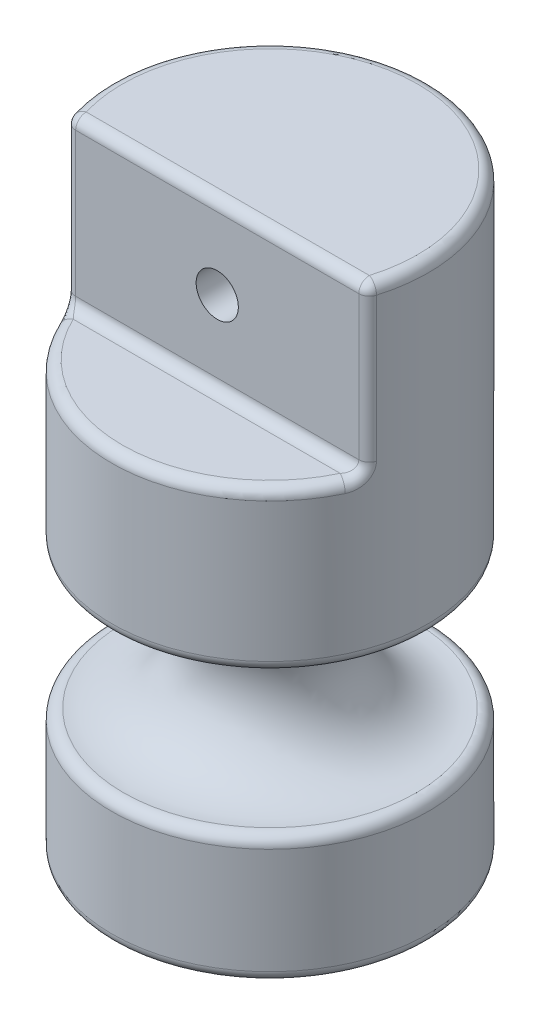
ISO-10303-21;
HEADER;
FILE_DESCRIPTION(('STEP AP214'),'2;1');
FILE_NAME('part.step','',(''),(''),'','','');
FILE_SCHEMA(('AUTOMOTIVE_DESIGN { 1 0 10303 214 1 1 1 1 }'));
ENDSEC;
DATA;
#1=APPLICATION_CONTEXT('core data for automotive mechanical design processes');
#2=APPLICATION_PROTOCOL_DEFINITION('international standard','automotive_design',2000,#1);
#3=PRODUCT_CONTEXT('',#1,'mechanical');
#4=PRODUCT('Part','Part','',(#3));
#5=PRODUCT_RELATED_PRODUCT_CATEGORY('part','',(#4));
#6=PRODUCT_DEFINITION_FORMATION('','',#4);
#7=PRODUCT_DEFINITION_CONTEXT('part definition',#1,'design');
#8=PRODUCT_DEFINITION('design','',#6,#7);
#9=PRODUCT_DEFINITION_SHAPE('','',#8);
#10=(LENGTH_UNIT() NAMED_UNIT(*) SI_UNIT(.MILLI.,.METRE.));
#11=(NAMED_UNIT(*) PLANE_ANGLE_UNIT() SI_UNIT($,.RADIAN.));
#12=(NAMED_UNIT(*) SI_UNIT($,.STERADIAN.) SOLID_ANGLE_UNIT());
#13=UNCERTAINTY_MEASURE_WITH_UNIT(LENGTH_MEASURE(1.E-05),#10,'distance_accuracy_value','');
#14=(GEOMETRIC_REPRESENTATION_CONTEXT(3) GLOBAL_UNCERTAINTY_ASSIGNED_CONTEXT((#13)) GLOBAL_UNIT_ASSIGNED_CONTEXT((#10,
#11,#12)) REPRESENTATION_CONTEXT('',''));
#15=CARTESIAN_POINT('',(0.,0.,0.));
#16=DIRECTION('',(0.,0.,1.));
#17=DIRECTION('',(1.,0.,0.));
#18=AXIS2_PLACEMENT_3D('',#15,#16,#17);
#19=CARTESIAN_POINT('',(0.,28.575,0.));
#20=DIRECTION('',(0.,-1.,0.));
#21=DIRECTION('',(0.,0.,-1.));
#22=AXIS2_PLACEMENT_3D('',#19,#20,#21);
#23=CYLINDRICAL_SURFACE('',#22,7.62);
#24=DIRECTION('',(0.,-1.,0.));
#25=VECTOR('',#24,1.);
#26=CARTESIAN_POINT('',(-7.30235913794931,28.575,2.17714285714286));
#27=LINE('',#26,#25);
#28=CARTESIAN_POINT('',(-7.30235913794931,21.1455,2.17714285714286));
#29=VERTEX_POINT('',#28);
#30=CARTESIAN_POINT('',(-7.30235913794931,28.067,2.17714285714286));
#31=VERTEX_POINT('',#30);
#32=EDGE_CURVE('E218',#29,#31,#27,.F.);
#33=ORIENTED_EDGE('',*,*,#32,.T.);
#34=CARTESIAN_POINT('',(0.,28.067,0.));
#35=DIRECTION('',(0.,1.,0.));
#36=DIRECTION('',(0.,0.,1.));
#37=AXIS2_PLACEMENT_3D('',#34,#35,#36);
#38=CIRCLE('',#37,7.62);
#39=CARTESIAN_POINT('',(7.30235913794931,28.067,2.17714285714286));
#40=VERTEX_POINT('',#39);
#41=EDGE_CURVE('E222',#31,#40,#38,.F.);
#42=ORIENTED_EDGE('',*,*,#41,.T.);
#43=DIRECTION('',(0.,-1.,0.));
#44=VECTOR('',#43,1.);
#45=CARTESIAN_POINT('',(7.30235913794931,28.575,2.17714285714286));
#46=LINE('',#45,#44);
#47=CARTESIAN_POINT('',(7.30235913794931,21.1455,2.17714285714286));
#48=VERTEX_POINT('',#47);
#49=EDGE_CURVE('E226',#40,#48,#46,.T.);
#50=ORIENTED_EDGE('',*,*,#49,.T.);
#51=CARTESIAN_POINT('',(6.79968366563213,21.306580535775,2.56621471484234));
#52=CARTESIAN_POINT('',(7.17973544291959,21.3416162058101,2.57792857301601));
#53=CARTESIAN_POINT('',(7.28537535603443,21.4676610715499,2.23331724609072));
#54=CARTESIAN_POINT('',(6.80497774516949,21.2807494491054,2.55754895045457));
#55=CARTESIAN_POINT('',(7.18453571792267,21.3104592178966,2.56537738077982));
#56=CARTESIAN_POINT('',(7.29104758409975,21.4159988982106,2.21474775097065));
#57=CARTESIAN_POINT('',(6.80894172480162,21.2541491386727,2.55099452658878));
#58=CARTESIAN_POINT('',(7.18814726576875,21.2781217778688,2.55589221225212));
#59=CARTESIAN_POINT('',(7.29529470513939,21.3627982773454,2.20070255697424));
#60=CARTESIAN_POINT('',(6.81421951672,21.2001992020795,2.54222267951877));
#61=CARTESIAN_POINT('',(7.19296371447863,21.2123725259241,2.54321396501279));
#62=CARTESIAN_POINT('',(7.30094948220521,21.254898404159,2.18190574182765));
#63=CARTESIAN_POINT('',(6.81553536425887,21.1728501677589,2.54000192566209));
#64=CARTESIAN_POINT('',(7.19417533686246,21.1789286468267,2.54000326881183));
#65=CARTESIAN_POINT('',(7.30235931885919,21.2002003355179,2.17714698356503));
#66=CARTESIAN_POINT('',(6.81553502530215,21.1179428590435,2.53999805976541));
#67=CARTESIAN_POINT('',(7.19417674767524,21.1118183333177,2.53999670644669));
#68=CARTESIAN_POINT('',(7.3023589556704,21.0903857180868,2.17713869949386));
#69=CARTESIAN_POINT('',(6.81419884545643,21.090384567429,2.5422486568872));
#70=CARTESIAN_POINT('',(7.19294813218279,21.0781197230295,2.54324958636573));
#71=CARTESIAN_POINT('',(7.30092733438081,21.0352691348577,2.18196140760333));
#72=CARTESIAN_POINT('',(6.80884454082101,21.0360668663769,2.55116480339701));
#73=CARTESIAN_POINT('',(7.18805509099758,21.0119226999059,2.55614048338698));
#74=CARTESIAN_POINT('',(7.29519057948787,20.926633732754,2.20106743586281));
#75=CARTESIAN_POINT('',(6.80482701876318,21.0093072788126,2.55782936057996));
#76=CARTESIAN_POINT('',(7.18438623490935,20.9793909218024,2.56579014755862));
#77=CARTESIAN_POINT('',(7.29088609166865,20.8731145576262,2.2153486298591));
#78=CARTESIAN_POINT('',(6.79409448148658,20.9573652018342,2.57532711071325));
#79=CARTESIAN_POINT('',(7.17467069258983,20.916694734701,2.59114753974169));
#80=CARTESIAN_POINT('',(7.27938694431339,20.7692304036675,2.25284380862639));
#81=CARTESIAN_POINT('',(6.78738238473865,20.9321810400903,2.58615579300261));
#82=CARTESIAN_POINT('',(7.16861561124709,20.8864947109692,2.60687702372217));
#83=CARTESIAN_POINT('',(7.2721954117109,20.7188620801766,2.27604812769551));
#84=CARTESIAN_POINT('',(6.77123490296656,20.8840117321596,2.61161589636088));
#85=CARTESIAN_POINT('',(7.15421729603453,20.8294712581727,2.64388692038416));
#86=CARTESIAN_POINT('',(7.25489453844513,20.6225234643209,2.33060549206124));
#87=CARTESIAN_POINT('',(6.76179579405356,20.8610296505729,2.62625251464366));
#88=CARTESIAN_POINT('',(7.14585232323247,20.802622392107,2.66522159925379));
#89=CARTESIAN_POINT('',(7.24478120790206,20.5765593011558,2.36196967424511));
#90=CARTESIAN_POINT('',(6.74010303868604,20.8176647043001,2.65898372414991));
#91=CARTESIAN_POINT('',(7.12690117420171,20.7530807193242,2.71292673382528));
#92=CARTESIAN_POINT('',(7.22153897003336,20.48982940859,2.43210798031245));
#93=CARTESIAN_POINT('',(6.72782106973793,20.7973114421398,2.67711278219986));
#94=CARTESIAN_POINT('',(7.11626467902644,20.7304136706803,2.7394150836419));
#95=CARTESIAN_POINT('',(7.20837971717004,20.4491228842407,2.47095596167793));
#96=CARTESIAN_POINT('',(6.70057507589932,20.7599544914172,2.71611391150444));
#97=CARTESIAN_POINT('',(7.09307171316821,20.6904312656857,2.79629729039291));
#98=CARTESIAN_POINT('',(7.17918758085032,20.3744089828083,2.55452981017262));
#99=CARTESIAN_POINT('',(6.68561011405877,20.7429519773653,2.73698694032223));
#100=CARTESIAN_POINT('',(7.08047582751609,20.6731140528903,2.82678168510133));
#101=CARTESIAN_POINT('',(7.16315369351915,20.3404039547464,2.59925772922304));
#102=CARTESIAN_POINT('',(6.65253752831066,20.7120469774421,2.78164032310655));
#103=CARTESIAN_POINT('',(7.05319047620054,20.6439132147723,2.89173048537433));
#104=CARTESIAN_POINT('',(7.12771878045249,20.2785939548678,2.69494354955439));
#105=CARTESIAN_POINT('',(6.63433194439553,20.6982871692617,2.80550111237467));
#106=CARTESIAN_POINT('',(7.03839248511933,20.6322929687462,2.92640359435825));
#107=CARTESIAN_POINT('',(7.10821279754744,20.2510743384284,2.74607381218687));
#108=CARTESIAN_POINT('',(6.59548990014568,20.6749333804866,2.85468140255819));
#109=CARTESIAN_POINT('',(7.00759966208699,20.6159059748189,2.99729222744497));
#110=CARTESIAN_POINT('',(7.06659632149319,20.2043667609342,2.85146014827172));
#111=CARTESIAN_POINT('',(6.57485525188372,20.6653363192248,2.87999980898227));
#112=CARTESIAN_POINT('',(6.99154687742234,20.6111998510151,3.03362635538824));
#113=CARTESIAN_POINT('',(7.04448776985038,20.1851726385448,2.90571387638543));
#114=CARTESIAN_POINT('',(6.53007075510555,20.649842781588,2.93309978019878));
#115=CARTESIAN_POINT('',(6.95772912973493,20.6086365336926,3.10888606071669));
#116=CARTESIAN_POINT('',(6.99650438049691,20.1541855630744,3.01949952900286));
#117=CARTESIAN_POINT('',(6.5057791585413,20.6442300520704,2.96093402773016));
#118=CARTESIAN_POINT('',(6.93987201924692,20.6113776245967,3.14791098997165));
#119=CARTESIAN_POINT('',(6.97047766987203,20.1429601036772,3.07914434508236));
#120=CARTESIAN_POINT('',(6.45531889818382,20.6376829760361,3.0167465518333));
#121=CARTESIAN_POINT('',(6.90427053929699,20.6244788179284,3.22451415729444));
#122=CARTESIAN_POINT('',(6.91641310518875,20.1298659515874,3.19874261100505));
#123=CARTESIAN_POINT('',(6.42914834692584,20.6367534025086,3.04472494626657));
#124=CARTESIAN_POINT('',(6.88647094455109,20.6350296012255,3.26218444518878));
#125=CARTESIAN_POINT('',(6.88837322884669,20.1280068048739,3.25869631340876));
#126=CARTESIAN_POINT('',(6.37323969679478,20.6395365720241,3.10251119357979));
#127=CARTESIAN_POINT('',(6.85045597050793,20.6644380305066,3.33756834367151));
#128=CARTESIAN_POINT('',(6.82847110371133,20.1335731442037,3.38252398626368));
#129=CARTESIAN_POINT('',(6.3433875836109,20.6436514140372,3.13227192661813));
#130=CARTESIAN_POINT('',(6.83234224655599,20.6841687325806,3.37496994258702));
#131=CARTESIAN_POINT('',(6.79648669672727,20.1418028281521,3.44629698562091));
#132=CARTESIAN_POINT('',(6.28308644750026,20.6569605335685,3.19041619456038));
#133=CARTESIAN_POINT('',(6.79875912182492,20.7305672478184,3.44422537820327));
#134=CARTESIAN_POINT('',(6.7318783366061,20.1684210670593,3.57089184547592));
#135=CARTESIAN_POINT('',(6.25263846699261,20.6661465930345,3.21880187703064));
#136=CARTESIAN_POINT('',(6.78331478389662,20.7575256321881,3.47602462478505));
#137=CARTESIAN_POINT('',(6.6992555003466,20.1867931859139,3.63171830790159));
#138=CARTESIAN_POINT('',(6.22229982419907,20.6777487969966,3.24617369171726));
#139=CARTESIAN_POINT('',(6.77027862712408,20.7867053260899,3.50334479811812));
#140=CARTESIAN_POINT('',(6.66674981164186,20.2099975939931,3.69037219653698));
#141=(BOUNDED_SURFACE() B_SPLINE_SURFACE(3,2,((#51,#52,#53),(#54,#55,#56),(#57,#58,#59),(#60,
#61,#62),(#63,#64,#65),(#66,#67,#68),(#69,#70,#71),(#72,#73,#74),(#75,#76,#77),(#78,#79,#80),
(#81,#82,#83),(#84,#85,#86),(#87,#88,#89),(#90,#91,#92),(#93,#94,#95),(#96,#97,#98),(#99,#100,
#101),(#102,#103,#104),(#105,#106,#107),(#108,#109,#110),(#111,#112,#113),(#114,#115,#116),
(#117,#118,#119),(#120,#121,#122),(#123,#124,#125),(#126,#127,#128),(#129,#130,#131),(#132,#133,
#134),(#135,#136,#137),(#138,#139,#140)),.UNSPECIFIED.,.F.,.F.,
.F.) B_SPLINE_SURFACE_WITH_KNOTS((4,2,2,2,2,2,2,2,2,2,2,2,2,2,4),(3,3),(0.,0.164035053180967,
0.327943987100401,0.493093306690423,0.658205515296487,0.82313937268745,0.988299529822666,
1.15518190987159,1.32212268221131,1.49541955266686,1.66858795394688,1.8531053382665,
2.03781074142979,2.23824634212784,2.43835808067002),(0.,1.),
.UNSPECIFIED.) GEOMETRIC_REPRESENTATION_ITEM() RATIONAL_B_SPLINE_SURFACE(((1.,0.79936283919541,
1.),(1.,0.800193144757819,1.),(1.,0.800798795144497,1.),(1.,0.801594208078721,1.),(1.,
0.801784290025917,1.),(1.,0.801783157178358,1.),(1.,0.801589046023793,1.),(1.,0.800786286877171,
1.),(1.,0.800177732046192,1.),(1.,0.798477356718461,1.),(1.,0.797386058946579,1.),(1.,
0.79461593553787,1.),(1.,0.79293630582987,1.),(1.,0.788852026960046,1.),(1.,0.786440000224402,
1.),(1.,0.78078327911004,1.),(1.,0.77753829367549,1.),(1.,0.76998497992151,1.),(1.,
0.765640869935332,1.),(1.,0.755905423610201,1.),(1.,0.750514865992914,1.),(1.,0.738282077340481,
1.),(1.,0.731367860763893,1.),(1.,0.716369915938221,1.),(1.,0.708285003163564,1.),(1.,
0.690303576835238,1.),(1.,0.680311419358112,1.),(1.,0.65929017184042,1.),(1.,0.648262783354108,
1.),(1.,0.636816887323215,1.))) REPRESENTATION_ITEM('') SURFACE());
#142=CARTESIAN_POINT('',(6.66674981164186,20.2099975939931,3.69037219653698));
#143=CARTESIAN_POINT('',(6.6992555003466,20.1867931859139,3.63171830790159));
#144=CARTESIAN_POINT('',(6.7318783366061,20.1684210670593,3.57089184547592));
#145=CARTESIAN_POINT('',(6.79648669672727,20.1418028281521,3.44629698562091));
#146=CARTESIAN_POINT('',(6.82847110371133,20.1335731442037,3.38252398626368));
#147=CARTESIAN_POINT('',(6.88837322884669,20.1280068048739,3.25869631340876));
#148=CARTESIAN_POINT('',(6.91641310518875,20.1298659515874,3.19874261100505));
#149=CARTESIAN_POINT('',(6.97047766987203,20.1429601036772,3.07914434508236));
#150=CARTESIAN_POINT('',(6.99650438049691,20.1541855630744,3.01949952900286));
#151=CARTESIAN_POINT('',(7.04448776985038,20.1851726385448,2.90571387638543));
#152=CARTESIAN_POINT('',(7.06659632149319,20.2043667609342,2.85146014827172));
#153=CARTESIAN_POINT('',(7.10821279754744,20.2510743384284,2.74607381218687));
#154=CARTESIAN_POINT('',(7.12771878045249,20.2785939548678,2.69494354955439));
#155=CARTESIAN_POINT('',(7.16315369351915,20.3404039547464,2.59925772922304));
#156=CARTESIAN_POINT('',(7.17918758085032,20.3744089828083,2.55452981017262));
#157=CARTESIAN_POINT('',(7.20837971717004,20.4491228842407,2.47095596167793));
#158=CARTESIAN_POINT('',(7.22153897003336,20.48982940859,2.43210798031245));
#159=CARTESIAN_POINT('',(7.24478120790206,20.5765593011558,2.36196967424511));
#160=CARTESIAN_POINT('',(7.25489453844513,20.6225234643209,2.33060549206124));
#161=CARTESIAN_POINT('',(7.2721954117109,20.7188620801766,2.27604812769551));
#162=CARTESIAN_POINT('',(7.27938694431339,20.7692304036675,2.25284380862639));
#163=CARTESIAN_POINT('',(7.29088609166865,20.8731145576262,2.2153486298591));
#164=CARTESIAN_POINT('',(7.29519057948788,20.926633732754,2.20106743586281));
#165=CARTESIAN_POINT('',(7.30092733438081,21.0352691348577,2.18196140760333));
#166=CARTESIAN_POINT('',(7.3023589556704,21.0903857180868,2.17713869949386));
#167=CARTESIAN_POINT('',(7.30235931885919,21.2002003355179,2.17714698356503));
#168=CARTESIAN_POINT('',(7.30094948220521,21.254898404159,2.18190574182765));
#169=CARTESIAN_POINT('',(7.29529470513939,21.3627982773454,2.20070255697424));
#170=CARTESIAN_POINT('',(7.29104758409975,21.4159988982106,2.21474775097065));
#171=CARTESIAN_POINT('',(7.28537535603443,21.4676610715499,2.23331724609072));
#172=B_SPLINE_CURVE_WITH_KNOTS('',3,(#142,#143,#144,#145,#146,#147,#148,#149,#150,#151,#152,
#153,#154,#155,#156,#157,#158,#159,#160,#161,#162,#163,#164,#165,#166,#167,#168,#169,#170,#171),
.UNSPECIFIED.,.F.,.F.,(4,2,2,2,2,2,2,2,2,2,2,2,2,2,4),(0.,0.200111738542182,0.400547339240226,
0.585252742403521,0.769770126723137,0.942938528003164,1.11623539845871,1.28317617079843,
1.45005855084735,1.61521870798257,1.78015256537353,1.9452647739796,2.11041409356962,
2.27432302748905,2.43835808067002),.UNSPECIFIED.);
#173=CARTESIAN_POINT('',(6.88473022013801,20.1295,3.26571428571429));
#174=VERTEX_POINT('',#173);
#175=EDGE_CURVE('E230',#174,#48,#172,.T.);
#176=ORIENTED_EDGE('',*,*,#175,.F.);
#177=CARTESIAN_POINT('',(0.,20.1295,0.));
#178=DIRECTION('',(0.,1.,0.));
#179=DIRECTION('',(-1.,0.,0.));
#180=AXIS2_PLACEMENT_3D('',#177,#178,#179);
#181=CIRCLE('',#180,7.62);
#182=CARTESIAN_POINT('',(-6.88473022013801,20.1295,3.26571428571429));
#183=VERTEX_POINT('',#182);
#184=EDGE_CURVE('E133',#174,#183,#181,.F.);
#185=ORIENTED_EDGE('',*,*,#184,.T.);
#186=CARTESIAN_POINT('',(-6.23300389654852,20.673755082059,3.23646944685233));
#187=CARTESIAN_POINT('',(-6.77506566820357,20.7763734186989,3.49332635180928));
#188=CARTESIAN_POINT('',(-6.6782184605877,20.202010164118,3.66957738611214));
#189=CARTESIAN_POINT('',(-6.26569017746966,20.6618801386209,3.20677135973496));
#190=CARTESIAN_POINT('',(-6.78959148857667,20.7456556350577,3.46305362232369));
#191=CARTESIAN_POINT('',(-6.71323947585647,20.1782602770079,3.60593862795744));
#192=CARTESIAN_POINT('',(-6.29843173739479,20.6528220312362,3.17592970832802));
#193=CARTESIAN_POINT('',(-6.80680752547643,20.7177159459926,3.42767565160285));
#194=CARTESIAN_POINT('',(-6.74831971863534,20.1601440623554,3.53984937496557));
#195=CARTESIAN_POINT('',(-6.36303276832924,20.640626646217,3.11280678148578));
#196=CARTESIAN_POINT('',(-6.84401099360203,20.6708899307042,3.35085237581777));
#197=CARTESIAN_POINT('',(-6.81753510892614,20.1357532925513,3.40458596034976));
#198=CARTESIAN_POINT('',(-6.39489054211745,20.6375000755361,3.08052301016632));
#199=CARTESIAN_POINT('',(-6.8639849009473,20.6516430645807,3.30944536936352));
#200=CARTESIAN_POINT('',(-6.85166843798689,20.1295001513069,3.33540645040263));
#201=CARTESIAN_POINT('',(-6.45362633469075,20.6374999317574,3.01861732542117));
#202=CARTESIAN_POINT('',(-6.90298888922068,20.6250522023248,3.22722505459486));
#203=CARTESIAN_POINT('',(-6.914599644308,20.1294998633029,3.20275141157504));
#204=CARTESIAN_POINT('',(-6.48068816514767,20.6400517358235,2.98903938203168));
#205=CARTESIAN_POINT('',(-6.92192338511761,20.616503364638,3.18677068825667));
#206=CARTESIAN_POINT('',(-6.9435944626464,20.1346034709356,3.13937010421347));
#207=CARTESIAN_POINT('',(-6.53250668855386,20.650420457087,2.93032509046503));
#208=CARTESIAN_POINT('',(-6.95943735689037,20.6084295073723,3.10513514773338));
#209=CARTESIAN_POINT('',(-6.99911430917239,20.15534091348,3.01355376515456));
#210=CARTESIAN_POINT('',(-6.55726575898052,20.6582318737653,2.90118831343137));
#211=CARTESIAN_POINT('',(-6.97808979153172,20.6087002773599,3.06382679489501));
#212=CARTESIAN_POINT('',(-7.02564188465716,20.170963747352,2.95111781447877));
#213=CARTESIAN_POINT('',(-6.6040276054449,20.6791999318016,2.84414986839671));
#214=CARTESIAN_POINT('',(-7.01418624808189,20.618279227387,2.98232281687623));
#215=CARTESIAN_POINT('',(-7.07574386294137,20.2128998637824,2.82889257515289));
#216=CARTESIAN_POINT('',(-6.62601895420574,20.6923778397221,2.81625360997935));
#217=CARTESIAN_POINT('',(-7.03171122247132,20.6274942714221,2.94196419558679));
#218=CARTESIAN_POINT('',(-7.09930602222937,20.2392556794632,2.76911487846695));
#219=CARTESIAN_POINT('',(-6.66667532428012,20.7239220364835,2.76287532910384));
#220=CARTESIAN_POINT('',(-7.06469885821343,20.6545440872705,2.86457445387583));
#221=CARTESIAN_POINT('',(-7.14286641878284,20.3023440728862,2.6547328480159));
#222=CARTESIAN_POINT('',(-6.68534065333209,20.7422878449092,2.73739308339257));
#223=CARTESIAN_POINT('',(-7.08024272146739,20.6723161176936,2.82737178080369));
#224=CARTESIAN_POINT('',(-7.16286498576803,20.3390756897984,2.60012803585124));
#225=CARTESIAN_POINT('',(-6.71786970440846,20.7823334462664,2.69158040441465));
#226=CARTESIAN_POINT('',(-7.10771008369736,20.714026585157,2.76055884071676));
#227=CARTESIAN_POINT('',(-7.19771754038637,20.4191668925514,2.50195800945064));
#228=CARTESIAN_POINT('',(-6.73197647680282,20.8036955396496,2.671015373363));
#229=CARTESIAN_POINT('',(-7.11985770950969,20.7374357310262,2.73049390449642));
#230=CARTESIAN_POINT('',(-7.2128319391568,20.4618910793013,2.45789008568664));
#231=CARTESIAN_POINT('',(-6.75691969931388,20.8499704317065,2.63374424813316));
#232=CARTESIAN_POINT('',(-7.14154666902698,20.7897821339162,2.67615495298914));
#233=CARTESIAN_POINT('',(-7.23955682060856,20.5544408634049,2.37802338881962));
#234=CARTESIAN_POINT('',(-6.76775729212808,20.8748819852212,2.61703680606705));
#235=CARTESIAN_POINT('',(-7.1511286333148,20.818742117157,2.65178385244449));
#236=CARTESIAN_POINT('',(-7.25116852760842,20.6042639704405,2.34222172738523));
#237=CARTESIAN_POINT('',(-6.78556701631876,20.9258762972694,2.58906299898635));
#238=CARTESIAN_POINT('',(-7.16698356316483,20.8789606363737,2.61110244842984));
#239=CARTESIAN_POINT('',(-7.27025037431901,20.7062525945405,2.28227785487811));
#240=CARTESIAN_POINT('',(-6.79273525970407,20.9517938449354,2.57752603310196));
#241=CARTESIAN_POINT('',(-7.17344377810494,20.9099966942418,2.59433867152452));
#242=CARTESIAN_POINT('',(-7.27793063412726,20.7580876898705,2.25755578482651));
#243=CARTESIAN_POINT('',(-6.80417916128596,21.0053290364162,2.5589000667228));
#244=CARTESIAN_POINT('',(-7.18379547245647,20.974560264323,2.56734140419597));
#245=CARTESIAN_POINT('',(-7.29019195723525,20.8651580728311,2.2176429997221));
#246=CARTESIAN_POINT('',(-6.80845557411516,21.0329462346478,2.55180990585479));
#247=CARTESIAN_POINT('',(-7.18770021701937,21.0081236034202,2.55707374638173));
#248=CARTESIAN_POINT('',(-7.29477382906945,20.9203924692952,2.20244979815506));
#249=CARTESIAN_POINT('',(-6.81405634557335,21.0882003317507,2.542488275851));
#250=CARTESIAN_POINT('',(-7.19281718648908,21.0754522073049,2.54359604017182));
#251=CARTESIAN_POINT('',(-7.30077465630087,21.0309006635018,2.18247487692562));
#252=CARTESIAN_POINT('',(-6.81546574875041,21.115811577334,2.54011688156708));
#253=CARTESIAN_POINT('',(-7.19411215835059,21.1092137063604,2.54016909382103));
#254=CARTESIAN_POINT('',(-7.30228473089268,21.0861231546681,2.17739331767121));
#255=CARTESIAN_POINT('',(-6.81559964598386,21.1710622313909,2.53989149704453));
#256=CARTESIAN_POINT('',(-7.19423533966218,21.1767423534925,2.53984301252538));
#257=CARTESIAN_POINT('',(-7.30242819203688,21.1966244627817,2.17691035078223));
#258=CARTESIAN_POINT('',(-6.81432355038394,21.1987016447175,2.54203849891244));
#259=CARTESIAN_POINT('',(-7.19306312736305,21.2105424761154,2.54294499360693));
#260=CARTESIAN_POINT('',(-7.30106094681469,21.2519032894349,2.18151106909027));
#261=CARTESIAN_POINT('',(-6.80909926622405,21.2529497251118,2.5507430628879));
#262=CARTESIAN_POINT('',(-7.18828695904988,21.2766643575578,2.55553122067653));
#263=CARTESIAN_POINT('',(-7.29546349955077,21.3603994502236,2.20016370619611));
#264=CARTESIAN_POINT('',(-6.80517549689292,21.279565482663,2.55726031521567));
#265=CARTESIAN_POINT('',(-7.18470043254069,21.3090294986109,2.564969745992));
#266=CARTESIAN_POINT('',(-7.29125946096921,21.4136309653261,2.21412924689459));
#267=CARTESIAN_POINT('',(-6.79465770050828,21.3313134529602,2.57440910089581));
#268=CARTESIAN_POINT('',(-7.17518237272498,21.3715125897223,2.5898119808376));
#269=CARTESIAN_POINT('',(-7.27999039338921,21.5171269059205,2.25087664477285));
#270=CARTESIAN_POINT('',(-6.78806222140296,21.356444850445,2.58504287140161));
#271=CARTESIAN_POINT('',(-7.16923892288188,21.4016622648624,2.60524638325631));
#272=CARTESIAN_POINT('',(-7.27292380862099,21.56738970089,2.27366329585283));
#273=CARTESIAN_POINT('',(-6.78012144280735,21.3804615318787,2.5976034208198));
#274=CARTESIAN_POINT('',(-7.16215394169549,21.4300751777457,2.62348571827467));
#275=CARTESIAN_POINT('',(-7.26441583157931,21.6154230637574,2.30057875889958));
#276=(BOUNDED_SURFACE() B_SPLINE_SURFACE(3,2,((#186,#187,#188),(#189,#190,#191),(#192,#193,
#194),(#195,#196,#197),(#198,#199,#200),(#201,#202,#203),(#204,#205,#206),(#207,#208,#209),
(#210,#211,#212),(#213,#214,#215),(#216,#217,#218),(#219,#220,#221),(#222,#223,#224),(#225,#226,
#227),(#228,#229,#230),(#231,#232,#233),(#234,#235,#236),(#237,#238,#239),(#240,#241,#242),
(#243,#244,#245),(#246,#247,#248),(#249,#250,#251),(#252,#253,#254),(#255,#256,#257),(#258,#259,
#260),(#261,#262,#263),(#264,#265,#266),(#267,#268,#269),(#270,#271,#272),(#273,#274,#275)),
.UNSPECIFIED.,.F.,.F.,.F.) B_SPLINE_SURFACE_WITH_KNOTS((4,2,2,2,2,2,2,2,2,2,2,2,2,2,4),(3,3),
(0.,0.215351295836915,0.431090951498596,0.625999358304664,0.820704245238461,1.01618834411827,
1.2116543465203,1.39357993252248,1.57544185501571,1.74616398929922,1.91684155587456,
2.08237778845746,2.24795037170704,2.4120163974442,2.57617171157963),(0.,1.),
.UNSPECIFIED.) GEOMETRIC_REPRESENTATION_ITEM() RATIONAL_B_SPLINE_SURFACE(((1.,0.640833627967316,
1.),(1.,0.653055828573706,1.),(1.,0.664766894246766,1.),(1.,0.686942023151236,1.),(1.,
0.697403799479261,1.),(1.,0.715872868719389,1.),(1.,0.724019621536861,1.),(1.,0.738984766490484,
1.),(1.,0.745804536794563,1.),(1.,0.758123410195284,1.),(1.,0.763617118735187,1.),(1.,
0.773298761630106,1.),(1.,0.777486816816998,1.),(1.,0.784430293709025,1.),(1.,0.787264860373656,
1.),(1.,0.792051589123845,1.),(1.,0.794004059653216,1.),(1.,0.797085631145561,1.),(1.,
0.798257841073842,1.),(1.,0.800078623199947,1.),(1.,0.800727332015646,1.),(1.,0.801568247672896,
1.),(1.,0.801773617121589,1.),(1.,0.801793099644634,1.),(1.,0.801607126791759,1.),(1.,
0.80082507889176,1.),(1.,0.800232750792937,1.),(1.,0.798566616304544,1.),(1.,0.79749254805916,
1.),(1.,0.79614022304563,1.))) REPRESENTATION_ITEM('') SURFACE());
#277=CARTESIAN_POINT('',(-7.26441583157931,21.6154230637574,2.30057875889958));
#278=CARTESIAN_POINT('',(-7.27292380862099,21.56738970089,2.27366329585283));
#279=CARTESIAN_POINT('',(-7.27999039338921,21.5171269059205,2.25087664477285));
#280=CARTESIAN_POINT('',(-7.29125946096921,21.4136309653261,2.21412924689459));
#281=CARTESIAN_POINT('',(-7.29546349955077,21.3603994502236,2.20016370619611));
#282=CARTESIAN_POINT('',(-7.30106094681469,21.2519032894349,2.18151106909027));
#283=CARTESIAN_POINT('',(-7.30242819203688,21.1966244627817,2.17691035078223));
#284=CARTESIAN_POINT('',(-7.30228473089268,21.0861231546681,2.17739331767121));
#285=CARTESIAN_POINT('',(-7.30077465630087,21.0309006635018,2.18247487692562));
#286=CARTESIAN_POINT('',(-7.29477382906945,20.9203924692952,2.20244979815506));
#287=CARTESIAN_POINT('',(-7.29019195723525,20.8651580728311,2.2176429997221));
#288=CARTESIAN_POINT('',(-7.27793063412726,20.7580876898705,2.25755578482651));
#289=CARTESIAN_POINT('',(-7.27025037431901,20.7062525945405,2.28227785487811));
#290=CARTESIAN_POINT('',(-7.25116852760842,20.6042639704405,2.34222172738523));
#291=CARTESIAN_POINT('',(-7.23955682060856,20.5544408634049,2.37802338881962));
#292=CARTESIAN_POINT('',(-7.2128319391568,20.4618910793013,2.45789008568664));
#293=CARTESIAN_POINT('',(-7.19771754038637,20.4191668925514,2.50195800945064));
#294=CARTESIAN_POINT('',(-7.16286498576803,20.3390756897984,2.60012803585124));
#295=CARTESIAN_POINT('',(-7.14286641878284,20.3023440728862,2.6547328480159));
#296=CARTESIAN_POINT('',(-7.09930602222937,20.2392556794632,2.76911487846695));
#297=CARTESIAN_POINT('',(-7.07574386294137,20.2128998637824,2.82889257515289));
#298=CARTESIAN_POINT('',(-7.02564188465716,20.170963747352,2.95111781447877));
#299=CARTESIAN_POINT('',(-6.99911430917239,20.15534091348,3.01355376515456));
#300=CARTESIAN_POINT('',(-6.9435944626464,20.1346034709356,3.13937010421347));
#301=CARTESIAN_POINT('',(-6.914599644308,20.1294998633029,3.20275141157504));
#302=CARTESIAN_POINT('',(-6.85166843798689,20.1295001513069,3.33540645040263));
#303=CARTESIAN_POINT('',(-6.81753510892614,20.1357532925513,3.40458596034976));
#304=CARTESIAN_POINT('',(-6.74831971863534,20.1601440623554,3.53984937496557));
#305=CARTESIAN_POINT('',(-6.71323947585647,20.1782602770079,3.60593862795744));
#306=CARTESIAN_POINT('',(-6.6782184605877,20.202010164118,3.66957738611214));
#307=B_SPLINE_CURVE_WITH_KNOTS('',3,(#277,#278,#279,#280,#281,#282,#283,#284,#285,#286,#287,
#288,#289,#290,#291,#292,#293,#294,#295,#296,#297,#298,#299,#300,#301,#302,#303,#304,#305,#306),
.UNSPECIFIED.,.F.,.F.,(4,2,2,2,2,2,2,2,2,2,2,2,2,2,4),(0.,0.164155314135423,0.328221339872586,
0.493793923122165,0.659330155705069,0.830007722280404,1.00072985656392,1.18259177905715,
1.36451736505933,1.55998336746136,1.75546746634117,1.95017235327496,2.14508076008103,
2.36082041574271,2.57617171157963),.UNSPECIFIED.);
#308=EDGE_CURVE('E125',#29,#183,#307,.T.);
#309=ORIENTED_EDGE('',*,*,#308,.F.);
#310=EDGE_LOOP('',(#33,#42,#50,#176,#185,#309));
#311=FACE_BOUND('',#310,.T.);
#312=CARTESIAN_POINT('',(0.,13.439899122485,0.));
#313=DIRECTION('',(0.,-1.,0.));
#314=DIRECTION('',(0.,0.,-1.));
#315=AXIS2_PLACEMENT_3D('',#312,#313,#314);
#316=CIRCLE('',#315,7.62);
#317=CARTESIAN_POINT('',(0.,13.439899122485,-7.62));
#318=VERTEX_POINT('',#317);
#319=EDGE_CURVE('E122',#318,#318,#316,.F.);
#320=ORIENTED_EDGE('',*,*,#319,.T.);
#321=EDGE_LOOP('',(#320));
#322=FACE_BOUND('',#321,.T.);
#323=ADVANCED_FACE('F33',(#311,#322),#23,.T.);
#324=CARTESIAN_POINT('',(0.,28.575,0.));
#325=DIRECTION('',(0.,1.,0.));
#326=DIRECTION('',(0.,0.,1.));
#327=AXIS2_PLACEMENT_3D('',#324,#325,#326);
#328=PLANE('',#327);
#329=DIRECTION('',(-1.,0.,0.));
#330=VECTOR('',#329,1.);
#331=CARTESIAN_POINT('',(7.18420489685532,28.575,2.032));
#332=LINE('',#331,#330);
#333=CARTESIAN_POINT('',(-6.81553519541936,28.575,2.032));
#334=VERTEX_POINT('',#333);
#335=CARTESIAN_POINT('',(6.81553519541936,28.575,2.032));
#336=VERTEX_POINT('',#335);
#337=EDGE_CURVE('E241',#334,#336,#332,.F.);
#338=ORIENTED_EDGE('',*,*,#337,.T.);
#339=CARTESIAN_POINT('',(0.,28.575,0.));
#340=DIRECTION('',(0.,1.,0.));
#341=DIRECTION('',(0.,0.,1.));
#342=AXIS2_PLACEMENT_3D('',#339,#340,#341);
#343=CIRCLE('',#342,7.112);
#344=EDGE_CURVE('E243',#336,#334,#343,.T.);
#345=ORIENTED_EDGE('',*,*,#344,.T.);
#346=EDGE_LOOP('',(#338,#345));
#347=FACE_BOUND('',#346,.T.);
#348=ADVANCED_FACE('F207',(#347),#328,.T.);
#349=CARTESIAN_POINT('',(0.,9.525,0.));
#350=DIRECTION('',(0.,1.,0.));
#351=DIRECTION('',(0.,0.,1.));
#352=AXIS2_PLACEMENT_3D('',#349,#350,#351);
#353=TOROIDAL_SURFACE('',#352,6.69542604406137,3.429);
#354=CARTESIAN_POINT('',(0.,6.11524915138397,0.));
#355=DIRECTION('',(0.,1.,0.));
#356=DIRECTION('',(0.,0.,1.));
#357=AXIS2_PLACEMENT_3D('',#354,#355,#356);
#358=CIRCLE('',#357,7.05824852181438);
#359=CARTESIAN_POINT('',(0.,6.11524915138397,7.05824852181438));
#360=VERTEX_POINT('',#359);
#361=EDGE_CURVE('E11',#360,#360,#358,.T.);
#362=ORIENTED_EDGE('',*,*,#361,.T.);
#363=EDGE_LOOP('',(#362));
#364=FACE_BOUND('',#363,.T.);
#365=CARTESIAN_POINT('',(0.,12.934750848616,0.));
#366=DIRECTION('',(0.,-1.,0.));
#367=DIRECTION('',(0.,0.,-1.));
#368=AXIS2_PLACEMENT_3D('',#365,#366,#367);
#369=CIRCLE('',#368,7.05824852181438);
#370=CARTESIAN_POINT('',(0.,12.934750848616,-7.05824852181438));
#371=VERTEX_POINT('',#370);
#372=EDGE_CURVE('E42',#371,#371,#369,.T.);
#373=ORIENTED_EDGE('',*,*,#372,.T.);
#374=EDGE_LOOP('',(#373));
#375=FACE_BOUND('',#374,.T.);
#376=ADVANCED_FACE('F213',(#364,#375),#353,.F.);
#377=CARTESIAN_POINT('',(0.,0.,0.));
#378=DIRECTION('',(0.,1.,0.));
#379=DIRECTION('',(0.,0.,1.));
#380=AXIS2_PLACEMENT_3D('',#377,#378,#379);
#381=PLANE('',#380);
#382=CARTESIAN_POINT('',(0.,0.,0.));
#383=DIRECTION('',(0.,1.,0.));
#384=DIRECTION('',(0.,0.,1.));
#385=AXIS2_PLACEMENT_3D('',#382,#383,#384);
#386=CIRCLE('',#385,7.112);
#387=CARTESIAN_POINT('',(0.,0.,7.112));
#388=VERTEX_POINT('',#387);
#389=EDGE_CURVE('E255',#388,#388,#386,.F.);
#390=ORIENTED_EDGE('',*,*,#389,.T.);
#391=EDGE_LOOP('',(#390));
#392=FACE_BOUND('',#391,.T.);
#393=CARTESIAN_POINT('',(0.,0.,0.));
#394=DIRECTION('',(0.,-1.,0.));
#395=DIRECTION('',(0.,0.,-1.));
#396=AXIS2_PLACEMENT_3D('',#393,#394,#395);
#397=CIRCLE('',#396,1.778);
#398=CARTESIAN_POINT('',(0.,0.,-1.778));
#399=VERTEX_POINT('',#398);
#400=EDGE_CURVE('E112',#399,#399,#397,.T.);
#401=ORIENTED_EDGE('',*,*,#400,.F.);
#402=EDGE_LOOP('',(#401));
#403=FACE_BOUND('',#402,.T.);
#404=ADVANCED_FACE('F143',(#392,#403),#381,.F.);
#405=CARTESIAN_POINT('',(0.,0.508000000000002,0.));
#406=DIRECTION('',(0.,1.,0.));
#407=DIRECTION('',(0.,0.,1.));
#408=AXIS2_PLACEMENT_3D('',#405,#406,#407);
#409=CIRCLE('',#408,7.62);
#410=CARTESIAN_POINT('',(0.,0.508000000000002,7.62));
#411=VERTEX_POINT('',#410);
#412=EDGE_CURVE('E252',#411,#411,#409,.T.);
#413=ORIENTED_EDGE('',*,*,#412,.T.);
#414=EDGE_LOOP('',(#413));
#415=FACE_BOUND('',#414,.T.);
#416=CARTESIAN_POINT('',(0.,5.61010087751502,0.));
#417=DIRECTION('',(0.,-1.,0.));
#418=DIRECTION('',(0.,0.,-1.));
#419=AXIS2_PLACEMENT_3D('',#416,#417,#418);
#420=CIRCLE('',#419,7.62);
#421=CARTESIAN_POINT('',(0.,5.61010087751502,-7.62));
#422=VERTEX_POINT('',#421);
#423=EDGE_CURVE('E249',#422,#422,#420,.T.);
#424=ORIENTED_EDGE('',*,*,#423,.T.);
#425=EDGE_LOOP('',(#424));
#426=FACE_BOUND('',#425,.T.);
#427=ADVANCED_FACE('F138',(#415,#426),#23,.T.);
#428=CARTESIAN_POINT('',(7.62,20.6375,7.62));
#429=DIRECTION('',(0.,1.,0.));
#430=DIRECTION('',(-1.,0.,0.));
#431=AXIS2_PLACEMENT_3D('',#428,#429,#430);
#432=PLANE('',#431);
#433=CARTESIAN_POINT('',(0.,20.6375,0.));
#434=DIRECTION('',(0.,1.,0.));
#435=DIRECTION('',(-1.,0.,0.));
#436=AXIS2_PLACEMENT_3D('',#433,#434,#435);
#437=CIRCLE('',#436,7.112);
#438=CARTESIAN_POINT('',(-6.42574820546215,20.6375,3.048));
#439=VERTEX_POINT('',#438);
#440=CARTESIAN_POINT('',(6.42574820546215,20.6375,3.048));
#441=VERTEX_POINT('',#440);
#442=EDGE_CURVE('E49',#439,#441,#437,.T.);
#443=ORIENTED_EDGE('',*,*,#442,.T.);
#444=DIRECTION('',(1.,0.,0.));
#445=VECTOR('',#444,1.);
#446=CARTESIAN_POINT('',(7.62,20.6375,3.048));
#447=LINE('',#446,#445);
#448=EDGE_CURVE('E247',#441,#439,#447,.F.);
#449=ORIENTED_EDGE('',*,*,#448,.T.);
#450=EDGE_LOOP('',(#443,#449));
#451=FACE_BOUND('',#450,.T.);
#452=ADVANCED_FACE('F142',(#451),#432,.T.);
#453=CARTESIAN_POINT('',(0.,0.,2.54));
#454=DIRECTION('',(0.,0.,-1.));
#455=DIRECTION('',(-1.,0.,0.));
#456=AXIS2_PLACEMENT_3D('',#453,#454,#455);
#457=PLANE('',#456);
#458=DIRECTION('',(0.,-1.,0.));
#459=VECTOR('',#458,1.);
#460=CARTESIAN_POINT('',(6.81553519541936,0.,2.54));
#461=LINE('',#460,#459);
#462=CARTESIAN_POINT('',(6.81553519541936,21.1455,2.54));
#463=VERTEX_POINT('',#462);
#464=CARTESIAN_POINT('',(6.81553519541936,28.067,2.54));
#465=VERTEX_POINT('',#464);
#466=EDGE_CURVE('E234',#463,#465,#461,.F.);
#467=ORIENTED_EDGE('',*,*,#466,.T.);
#468=DIRECTION('',(-1.,0.,0.));
#469=VECTOR('',#468,1.);
#470=CARTESIAN_POINT('',(-7.18420489685532,28.067,2.54));
#471=LINE('',#470,#469);
#472=CARTESIAN_POINT('',(-6.81553519541936,28.067,2.54));
#473=VERTEX_POINT('',#472);
#474=EDGE_CURVE('E239',#465,#473,#471,.T.);
#475=ORIENTED_EDGE('',*,*,#474,.T.);
#476=DIRECTION('',(0.,-1.,0.));
#477=VECTOR('',#476,1.);
#478=CARTESIAN_POINT('',(-6.81553519541936,0.,2.54));
#479=LINE('',#478,#477);
#480=CARTESIAN_POINT('',(-6.81553519541936,21.1455,2.54));
#481=VERTEX_POINT('',#480);
#482=EDGE_CURVE('E236',#473,#481,#479,.T.);
#483=ORIENTED_EDGE('',*,*,#482,.T.);
#484=DIRECTION('',(1.,0.,0.));
#485=VECTOR('',#484,1.);
#486=CARTESIAN_POINT('',(0.,21.1455,2.54));
#487=LINE('',#486,#485);
#488=EDGE_CURVE('E228',#481,#463,#487,.T.);
#489=ORIENTED_EDGE('',*,*,#488,.T.);
#490=EDGE_LOOP('',(#467,#475,#483,#489));
#491=FACE_BOUND('',#490,.T.);
#492=CARTESIAN_POINT('',(0.,24.60625,2.54));
#493=DIRECTION('',(0.,0.,1.));
#494=DIRECTION('',(1.,0.,0.));
#495=AXIS2_PLACEMENT_3D('',#492,#493,#494);
#496=CIRCLE('',#495,1.01599999999999);
#497=CARTESIAN_POINT('',(1.01599999999999,24.60625,2.54));
#498=VERTEX_POINT('',#497);
#499=EDGE_CURVE('E111',#498,#498,#496,.T.);
#500=ORIENTED_EDGE('',*,*,#499,.F.);
#501=EDGE_LOOP('',(#500));
#502=FACE_BOUND('',#501,.T.);
#503=ADVANCED_FACE('F329',(#491,#502),#457,.F.);
#504=CARTESIAN_POINT('',(0.,24.60625,-3.80999999999999));
#505=DIRECTION('',(0.,0.,1.));
#506=DIRECTION('',(1.,0.,0.));
#507=AXIS2_PLACEMENT_3D('',#504,#505,#506);
#508=CONICAL_SURFACE('',#507,1.01599999999999,1.02974425867665);
#509=CARTESIAN_POINT('',(0.,24.60625,-4.42047438893199));
#510=VERTEX_POINT('',#509);
#511=VERTEX_LOOP('',#510);
#512=FACE_BOUND('',#511,.T.);
#513=CARTESIAN_POINT('',(0.,24.60625,-3.80999999999999));
#514=DIRECTION('',(0.,0.,1.));
#515=DIRECTION('',(1.,0.,0.));
#516=AXIS2_PLACEMENT_3D('',#513,#514,#515);
#517=CIRCLE('',#516,1.01599999999999);
#518=CARTESIAN_POINT('',(1.01599999999999,24.60625,-3.80999999999999));
#519=VERTEX_POINT('',#518);
#520=EDGE_CURVE('E115',#519,#519,#517,.T.);
#521=ORIENTED_EDGE('',*,*,#520,.T.);
#522=EDGE_LOOP('',(#521));
#523=FACE_BOUND('',#522,.T.);
#524=ADVANCED_FACE('F332',(#512,#523),#508,.F.);
#525=CARTESIAN_POINT('',(0.,24.60625,2.54));
#526=DIRECTION('',(0.,0.,1.));
#527=DIRECTION('',(1.,0.,0.));
#528=AXIS2_PLACEMENT_3D('',#525,#526,#527);
#529=CYLINDRICAL_SURFACE('',#528,1.01599999999999);
#530=ORIENTED_EDGE('',*,*,#520,.F.);
#531=EDGE_LOOP('',(#530));
#532=FACE_BOUND('',#531,.T.);
#533=ORIENTED_EDGE('',*,*,#499,.T.);
#534=EDGE_LOOP('',(#533));
#535=FACE_BOUND('',#534,.T.);
#536=ADVANCED_FACE('F105',(#532,#535),#529,.F.);
#537=CARTESIAN_POINT('',(0.,6.35,0.));
#538=DIRECTION('',(0.,-1.,0.));
#539=DIRECTION('',(0.,0.,-1.));
#540=AXIS2_PLACEMENT_3D('',#537,#538,#539);
#541=CONICAL_SURFACE('',#540,1.778,1.02974425867665);
#542=CARTESIAN_POINT('',(0.,7.418330180631,0.));
#543=VERTEX_POINT('',#542);
#544=VERTEX_LOOP('',#543);
#545=FACE_BOUND('',#544,.T.);
#546=CARTESIAN_POINT('',(0.,6.35,0.));
#547=DIRECTION('',(0.,-1.,0.));
#548=DIRECTION('',(0.,0.,-1.));
#549=AXIS2_PLACEMENT_3D('',#546,#547,#548);
#550=CIRCLE('',#549,1.778);
#551=CARTESIAN_POINT('',(0.,6.35,-1.778));
#552=VERTEX_POINT('',#551);
#553=EDGE_CURVE('E109',#552,#552,#550,.T.);
#554=ORIENTED_EDGE('',*,*,#553,.T.);
#555=EDGE_LOOP('',(#554));
#556=FACE_BOUND('',#555,.T.);
#557=ADVANCED_FACE('F101',(#545,#556),#541,.F.);
#558=CARTESIAN_POINT('',(0.,0.,0.));
#559=DIRECTION('',(0.,-1.,0.));
#560=DIRECTION('',(0.,0.,-1.));
#561=AXIS2_PLACEMENT_3D('',#558,#559,#560);
#562=CYLINDRICAL_SURFACE('',#561,1.778);
#563=ORIENTED_EDGE('',*,*,#553,.F.);
#564=EDGE_LOOP('',(#563));
#565=FACE_BOUND('',#564,.T.);
#566=ORIENTED_EDGE('',*,*,#400,.T.);
#567=EDGE_LOOP('',(#566));
#568=FACE_BOUND('',#567,.T.);
#569=ADVANCED_FACE('F104',(#565,#568),#562,.F.);
#570=CARTESIAN_POINT('',(6.81553519541936,28.575,2.032));
#571=DIRECTION('',(0.,-1.,0.));
#572=DIRECTION('',(0.,0.,-1.));
#573=AXIS2_PLACEMENT_3D('',#570,#571,#572);
#574=CYLINDRICAL_SURFACE('',#573,0.508);
#575=CARTESIAN_POINT('',(6.81553519541936,21.1455,2.032));
#576=DIRECTION('',(0.,-1.,0.));
#577=DIRECTION('',(0.,0.,-1.));
#578=AXIS2_PLACEMENT_3D('',#575,#576,#577);
#579=CIRCLE('',#578,0.508);
#580=EDGE_CURVE('E37',#48,#463,#579,.T.);
#581=ORIENTED_EDGE('',*,*,#580,.F.);
#582=ORIENTED_EDGE('',*,*,#49,.F.);
#583=CARTESIAN_POINT('',(6.81553519541936,28.067,2.032));
#584=DIRECTION('',(0.,1.,0.));
#585=DIRECTION('',(0.,0.,1.));
#586=AXIS2_PLACEMENT_3D('',#583,#584,#585);
#587=CIRCLE('',#586,0.508);
#588=EDGE_CURVE('E184',#465,#40,#587,.T.);
#589=ORIENTED_EDGE('',*,*,#588,.F.);
#590=ORIENTED_EDGE('',*,*,#466,.F.);
#591=EDGE_LOOP('',(#581,#582,#589,#590));
#592=FACE_BOUND('',#591,.T.);
#593=ADVANCED_FACE('F162',(#592),#574,.T.);
#594=ORIENTED_EDGE('',*,*,#175,.T.);
#595=ORIENTED_EDGE('',*,*,#580,.T.);
#596=CARTESIAN_POINT('',(6.79968366563213,21.306580535775,2.56621471484234));
#597=CARTESIAN_POINT('',(6.80497774516949,21.2807494491054,2.55754895045457));
#598=CARTESIAN_POINT('',(6.80894172480162,21.2541491386727,2.55099452658878));
#599=CARTESIAN_POINT('',(6.81421951672,21.2001992020795,2.54222267951877));
#600=CARTESIAN_POINT('',(6.81553536425887,21.1728501677589,2.54000192566209));
#601=CARTESIAN_POINT('',(6.81553502530215,21.1179428590435,2.53999805976541));
#602=CARTESIAN_POINT('',(6.81419884545643,21.090384567429,2.5422486568872));
#603=CARTESIAN_POINT('',(6.80884454082101,21.0360668663769,2.55116480339701));
#604=CARTESIAN_POINT('',(6.80482701876318,21.0093072788126,2.55782936057996));
#605=CARTESIAN_POINT('',(6.79409448148658,20.9573652018342,2.57532711071325));
#606=CARTESIAN_POINT('',(6.78738238473865,20.9321810400903,2.58615579300261));
#607=CARTESIAN_POINT('',(6.77123490296655,20.8840117321596,2.61161589636088));
#608=CARTESIAN_POINT('',(6.76179579405356,20.8610296505729,2.62625251464366));
#609=CARTESIAN_POINT('',(6.74010303868604,20.8176647043001,2.65898372414991));
#610=CARTESIAN_POINT('',(6.72782106973793,20.7973114421398,2.67711278219986));
#611=CARTESIAN_POINT('',(6.70057507589932,20.7599544914172,2.71611391150444));
#612=CARTESIAN_POINT('',(6.68561011405878,20.7429519773653,2.73698694032223));
#613=CARTESIAN_POINT('',(6.65253752831066,20.7120469774421,2.78164032310655));
#614=CARTESIAN_POINT('',(6.63433194439553,20.6982871692617,2.80550111237467));
#615=CARTESIAN_POINT('',(6.59548990014568,20.6749333804866,2.85468140255819));
#616=CARTESIAN_POINT('',(6.57485525188372,20.6653363192248,2.87999980898227));
#617=CARTESIAN_POINT('',(6.53007075510555,20.649842781588,2.93309978019878));
#618=CARTESIAN_POINT('',(6.5057791585413,20.6442300520704,2.96093402773016));
#619=CARTESIAN_POINT('',(6.45531889818382,20.6376829760361,3.0167465518333));
#620=CARTESIAN_POINT('',(6.42914834692584,20.6367534025086,3.04472494626657));
#621=CARTESIAN_POINT('',(6.37323969679478,20.6395365720241,3.10251119357979));
#622=CARTESIAN_POINT('',(6.3433875836109,20.6436514140372,3.13227192661813));
#623=CARTESIAN_POINT('',(6.28308644750025,20.6569605335685,3.19041619456038));
#624=CARTESIAN_POINT('',(6.25263846699261,20.6661465930345,3.21880187703064));
#625=CARTESIAN_POINT('',(6.22229982419907,20.6777487969966,3.24617369171726));
#626=B_SPLINE_CURVE_WITH_KNOTS('',3,(#596,#597,#598,#599,#600,#601,#602,#603,#604,#605,#606,
#607,#608,#609,#610,#611,#612,#613,#614,#615,#616,#617,#618,#619,#620,#621,#622,#623,#624,#625),
.UNSPECIFIED.,.F.,.F.,(4,2,2,2,2,2,2,2,2,2,2,2,2,2,4),(0.,0.164035053180967,0.327943987100401,
0.493093306690423,0.658205515296487,0.82313937268745,0.988299529822666,1.15518190987159,
1.32212268221131,1.49541955266686,1.66858795394688,1.8531053382665,2.03781074142979,
2.23824634212784,2.43835808067002),.UNSPECIFIED.);
#627=EDGE_CURVE('E178',#441,#463,#626,.F.);
#628=ORIENTED_EDGE('',*,*,#627,.F.);
#629=CARTESIAN_POINT('',(6.42574820546215,20.1295,3.048));
#630=DIRECTION('',(0.428571428571428,0.,-0.903507902905251));
#631=DIRECTION('',(-0.903507902905251,0.,-0.428571428571428));
#632=AXIS2_PLACEMENT_3D('',#629,#630,#631);
#633=CIRCLE('',#632,0.508);
#634=EDGE_CURVE('E316',#174,#441,#633,.F.);
#635=ORIENTED_EDGE('',*,*,#634,.F.);
#636=EDGE_LOOP('',(#594,#595,#628,#635));
#637=FACE_BOUND('',#636,.T.);
#638=ADVANCED_FACE('F155',(#637),#141,.T.);
#639=CARTESIAN_POINT('',(6.81553519541936,28.067,2.032));
#640=DIRECTION('',(0.,0.,1.));
#641=DIRECTION('',(1.,0.,0.));
#642=AXIS2_PLACEMENT_3D('',#639,#640,#641);
#643=SPHERICAL_SURFACE('',#642,0.508);
#644=CARTESIAN_POINT('',(6.81553519541936,28.067,2.032));
#645=DIRECTION('',(1.,0.,0.));
#646=DIRECTION('',(0.,0.,-1.));
#647=AXIS2_PLACEMENT_3D('',#644,#645,#646);
#648=CIRCLE('',#647,0.508);
#649=EDGE_CURVE('E275',#465,#336,#648,.F.);
#650=ORIENTED_EDGE('',*,*,#649,.F.);
#651=ORIENTED_EDGE('',*,*,#588,.T.);
#652=CARTESIAN_POINT('',(6.81553519541936,28.067,2.032));
#653=DIRECTION('',(-0.285714285714286,0.,0.95831484749991));
#654=DIRECTION('',(0.95831484749991,0.,0.285714285714286));
#655=AXIS2_PLACEMENT_3D('',#652,#653,#654);
#656=CIRCLE('',#655,0.508);
#657=EDGE_CURVE('E313',#336,#40,#656,.F.);
#658=ORIENTED_EDGE('',*,*,#657,.F.);
#659=EDGE_LOOP('',(#650,#651,#658));
#660=FACE_BOUND('',#659,.T.);
#661=ADVANCED_FACE('F161',(#660),#643,.T.);
#662=CARTESIAN_POINT('',(0.,21.1455,3.048));
#663=DIRECTION('',(1.,0.,0.));
#664=DIRECTION('',(0.,1.,0.));
#665=AXIS2_PLACEMENT_3D('',#662,#663,#664);
#666=CYLINDRICAL_SURFACE('',#665,0.508);
#667=ORIENTED_EDGE('',*,*,#627,.T.);
#668=ORIENTED_EDGE('',*,*,#488,.F.);
#669=CARTESIAN_POINT('',(-6.23300389654852,20.673755082059,3.23646944685233));
#670=CARTESIAN_POINT('',(-6.26569017746966,20.6618801386209,3.20677135973496));
#671=CARTESIAN_POINT('',(-6.29843173739479,20.6528220312362,3.17592970832802));
#672=CARTESIAN_POINT('',(-6.36303276832924,20.640626646217,3.11280678148578));
#673=CARTESIAN_POINT('',(-6.39489054211745,20.6375000755361,3.08052301016632));
#674=CARTESIAN_POINT('',(-6.45362633469076,20.6374999317574,3.01861732542117));
#675=CARTESIAN_POINT('',(-6.48068816514767,20.6400517358235,2.98903938203168));
#676=CARTESIAN_POINT('',(-6.53250668855386,20.650420457087,2.93032509046503));
#677=CARTESIAN_POINT('',(-6.55726575898052,20.6582318737653,2.90118831343137));
#678=CARTESIAN_POINT('',(-6.6040276054449,20.6791999318016,2.84414986839671));
#679=CARTESIAN_POINT('',(-6.62601895420574,20.6923778397221,2.81625360997935));
#680=CARTESIAN_POINT('',(-6.66667532428012,20.7239220364835,2.76287532910384));
#681=CARTESIAN_POINT('',(-6.68534065333209,20.7422878449092,2.73739308339257));
#682=CARTESIAN_POINT('',(-6.71786970440846,20.7823334462663,2.69158040441465));
#683=CARTESIAN_POINT('',(-6.73197647680282,20.8036955396496,2.671015373363));
#684=CARTESIAN_POINT('',(-6.75691969931388,20.8499704317065,2.63374424813316));
#685=CARTESIAN_POINT('',(-6.76775729212808,20.8748819852212,2.61703680606705));
#686=CARTESIAN_POINT('',(-6.78556701631876,20.9258762972694,2.58906299898635));
#687=CARTESIAN_POINT('',(-6.79273525970407,20.9517938449354,2.57752603310196));
#688=CARTESIAN_POINT('',(-6.80417916128596,21.0053290364162,2.5589000667228));
#689=CARTESIAN_POINT('',(-6.80845557411516,21.0329462346478,2.55180990585479));
#690=CARTESIAN_POINT('',(-6.81405634557335,21.0882003317507,2.542488275851));
#691=CARTESIAN_POINT('',(-6.81546574875041,21.115811577334,2.54011688156708));
#692=CARTESIAN_POINT('',(-6.81559964598386,21.1710622313909,2.53989149704453));
#693=CARTESIAN_POINT('',(-6.81432355038394,21.1987016447175,2.54203849891244));
#694=CARTESIAN_POINT('',(-6.80909926622405,21.2529497251118,2.5507430628879));
#695=CARTESIAN_POINT('',(-6.80517549689292,21.279565482663,2.55726031521567));
#696=CARTESIAN_POINT('',(-6.79465770050828,21.3313134529602,2.57440910089581));
#697=CARTESIAN_POINT('',(-6.78806222140296,21.356444850445,2.58504287140161));
#698=CARTESIAN_POINT('',(-6.78012144280735,21.3804615318787,2.5976034208198));
#699=B_SPLINE_CURVE_WITH_KNOTS('',3,(#669,#670,#671,#672,#673,#674,#675,#676,#677,#678,#679,
#680,#681,#682,#683,#684,#685,#686,#687,#688,#689,#690,#691,#692,#693,#694,#695,#696,#697,#698),
.UNSPECIFIED.,.F.,.F.,(4,2,2,2,2,2,2,2,2,2,2,2,2,2,4),(0.,0.215351295836915,0.431090951498596,
0.625999358304664,0.820704245238461,1.01618834411827,1.2116543465203,1.39357993252248,
1.57544185501571,1.74616398929922,1.91684155587456,2.08237778845746,2.24795037170704,
2.4120163974442,2.57617171157963),.UNSPECIFIED.);
#700=EDGE_CURVE('E270',#439,#481,#699,.T.);
#701=ORIENTED_EDGE('',*,*,#700,.F.);
#702=ORIENTED_EDGE('',*,*,#448,.F.);
#703=EDGE_LOOP('',(#667,#668,#701,#702));
#704=FACE_BOUND('',#703,.T.);
#705=ADVANCED_FACE('F169',(#704),#666,.F.);
#706=CARTESIAN_POINT('',(0.,20.1295,0.));
#707=DIRECTION('',(0.,1.,0.));
#708=DIRECTION('',(-1.,0.,0.));
#709=AXIS2_PLACEMENT_3D('',#706,#707,#708);
#710=TOROIDAL_SURFACE('',#709,7.112,0.508);
#711=ORIENTED_EDGE('',*,*,#634,.T.);
#712=ORIENTED_EDGE('',*,*,#442,.F.);
#713=CARTESIAN_POINT('',(-6.42574820546215,20.1295,3.048));
#714=DIRECTION('',(-0.428571428571429,0.,-0.903507902905251));
#715=DIRECTION('',(-0.903507902905251,0.,0.428571428571429));
#716=AXIS2_PLACEMENT_3D('',#713,#714,#715);
#717=CIRCLE('',#716,0.508);
#718=EDGE_CURVE('E57',#183,#439,#717,.T.);
#719=ORIENTED_EDGE('',*,*,#718,.F.);
#720=ORIENTED_EDGE('',*,*,#184,.F.);
#721=EDGE_LOOP('',(#711,#712,#719,#720));
#722=FACE_BOUND('',#721,.T.);
#723=ADVANCED_FACE('F300',(#722),#710,.T.);
#724=CARTESIAN_POINT('',(0.,28.067,0.));
#725=DIRECTION('',(0.,1.,0.));
#726=DIRECTION('',(0.,0.,1.));
#727=AXIS2_PLACEMENT_3D('',#724,#725,#726);
#728=TOROIDAL_SURFACE('',#727,7.112,0.508);
#729=ORIENTED_EDGE('',*,*,#657,.T.);
#730=ORIENTED_EDGE('',*,*,#41,.F.);
#731=CARTESIAN_POINT('',(-6.81553519541936,28.067,2.032));
#732=DIRECTION('',(0.285714285714287,0.,0.958314847499909));
#733=DIRECTION('',(0.958314847499909,0.,-0.285714285714287));
#734=AXIS2_PLACEMENT_3D('',#731,#732,#733);
#735=CIRCLE('',#734,0.508);
#736=EDGE_CURVE('E266',#334,#31,#735,.T.);
#737=ORIENTED_EDGE('',*,*,#736,.F.);
#738=ORIENTED_EDGE('',*,*,#344,.F.);
#739=EDGE_LOOP('',(#729,#730,#737,#738));
#740=FACE_BOUND('',#739,.T.);
#741=ADVANCED_FACE('F311',(#740),#728,.T.);
#742=CARTESIAN_POINT('',(0.,28.067,2.032));
#743=DIRECTION('',(1.,0.,0.));
#744=DIRECTION('',(0.,0.,-1.));
#745=AXIS2_PLACEMENT_3D('',#742,#743,#744);
#746=CYLINDRICAL_SURFACE('',#745,0.508);
#747=ORIENTED_EDGE('',*,*,#649,.T.);
#748=ORIENTED_EDGE('',*,*,#337,.F.);
#749=CARTESIAN_POINT('',(-6.81553519541936,28.067,2.032));
#750=DIRECTION('',(-1.,0.,0.));
#751=DIRECTION('',(0.,-1.,0.));
#752=AXIS2_PLACEMENT_3D('',#749,#750,#751);
#753=CIRCLE('',#752,0.508);
#754=EDGE_CURVE('E264',#473,#334,#753,.T.);
#755=ORIENTED_EDGE('',*,*,#754,.F.);
#756=ORIENTED_EDGE('',*,*,#474,.F.);
#757=EDGE_LOOP('',(#747,#748,#755,#756));
#758=FACE_BOUND('',#757,.T.);
#759=ADVANCED_FACE('F321',(#758),#746,.T.);
#760=ORIENTED_EDGE('',*,*,#718,.T.);
#761=ORIENTED_EDGE('',*,*,#700,.T.);
#762=CARTESIAN_POINT('',(-6.81553519541936,21.1455,2.032));
#763=DIRECTION('',(0.,-1.,0.));
#764=DIRECTION('',(0.,0.,-1.));
#765=AXIS2_PLACEMENT_3D('',#762,#763,#764);
#766=CIRCLE('',#765,0.508);
#767=EDGE_CURVE('E262',#29,#481,#766,.F.);
#768=ORIENTED_EDGE('',*,*,#767,.F.);
#769=ORIENTED_EDGE('',*,*,#308,.T.);
#770=EDGE_LOOP('',(#760,#761,#768,#769));
#771=FACE_BOUND('',#770,.T.);
#772=ADVANCED_FACE('F148',(#771),#276,.T.);
#773=CARTESIAN_POINT('',(-6.81553519541936,28.067,2.032));
#774=DIRECTION('',(0.,0.,1.));
#775=DIRECTION('',(1.,0.,0.));
#776=AXIS2_PLACEMENT_3D('',#773,#774,#775);
#777=SPHERICAL_SURFACE('',#776,0.508);
#778=ORIENTED_EDGE('',*,*,#754,.T.);
#779=ORIENTED_EDGE('',*,*,#736,.T.);
#780=CARTESIAN_POINT('',(-6.81553519541936,28.067,2.032));
#781=DIRECTION('',(0.,1.,0.));
#782=DIRECTION('',(0.,0.,1.));
#783=AXIS2_PLACEMENT_3D('',#780,#781,#782);
#784=CIRCLE('',#783,0.508);
#785=EDGE_CURVE('E260',#473,#31,#784,.F.);
#786=ORIENTED_EDGE('',*,*,#785,.F.);
#787=EDGE_LOOP('',(#778,#779,#786));
#788=FACE_BOUND('',#787,.T.);
#789=ADVANCED_FACE('F285',(#788),#777,.T.);
#790=CARTESIAN_POINT('',(-6.81553519541936,28.575,2.032));
#791=DIRECTION('',(0.,-1.,0.));
#792=DIRECTION('',(0.,0.,-1.));
#793=AXIS2_PLACEMENT_3D('',#790,#791,#792);
#794=CYLINDRICAL_SURFACE('',#793,0.508);
#795=ORIENTED_EDGE('',*,*,#767,.T.);
#796=ORIENTED_EDGE('',*,*,#482,.F.);
#797=ORIENTED_EDGE('',*,*,#785,.T.);
#798=ORIENTED_EDGE('',*,*,#32,.F.);
#799=EDGE_LOOP('',(#795,#796,#797,#798));
#800=FACE_BOUND('',#799,.T.);
#801=ADVANCED_FACE('F196',(#800),#794,.T.);
#802=CARTESIAN_POINT('',(0.,0.508000000000002,0.));
#803=DIRECTION('',(0.,1.,0.));
#804=DIRECTION('',(0.,0.,1.));
#805=AXIS2_PLACEMENT_3D('',#802,#803,#804);
#806=TOROIDAL_SURFACE('',#805,7.112,0.508);
#807=ORIENTED_EDGE('',*,*,#389,.F.);
#808=EDGE_LOOP('',(#807));
#809=FACE_BOUND('',#808,.T.);
#810=ORIENTED_EDGE('',*,*,#412,.F.);
#811=EDGE_LOOP('',(#810));
#812=FACE_BOUND('',#811,.T.);
#813=ADVANCED_FACE('F193',(#809,#812),#806,.T.);
#814=CARTESIAN_POINT('',(0.,5.61010087751502,0.));
#815=DIRECTION('',(0.,-1.,0.));
#816=DIRECTION('',(0.,0.,-1.));
#817=AXIS2_PLACEMENT_3D('',#814,#815,#816);
#818=TOROIDAL_SURFACE('',#817,7.112,0.508);
#819=ORIENTED_EDGE('',*,*,#423,.F.);
#820=EDGE_LOOP('',(#819));
#821=FACE_BOUND('',#820,.T.);
#822=ORIENTED_EDGE('',*,*,#361,.F.);
#823=EDGE_LOOP('',(#822));
#824=FACE_BOUND('',#823,.T.);
#825=ADVANCED_FACE('F195',(#821,#824),#818,.T.);
#826=CARTESIAN_POINT('',(0.,13.439899122485,0.));
#827=DIRECTION('',(0.,-1.,0.));
#828=DIRECTION('',(0.,0.,-1.));
#829=AXIS2_PLACEMENT_3D('',#826,#827,#828);
#830=TOROIDAL_SURFACE('',#829,7.112,0.508);
#831=ORIENTED_EDGE('',*,*,#372,.F.);
#832=EDGE_LOOP('',(#831));
#833=FACE_BOUND('',#832,.T.);
#834=ORIENTED_EDGE('',*,*,#319,.F.);
#835=EDGE_LOOP('',(#834));
#836=FACE_BOUND('',#835,.T.);
#837=ADVANCED_FACE('F35',(#833,#836),#830,.T.);
#838=CLOSED_SHELL('',(#323,#348,#376,#404,#427,#452,#503,#524,#536,#557,#569,#593,#638,#661,
#705,#723,#741,#759,#772,#789,#801,#813,#825,#837));
#839=MANIFOLD_SOLID_BREP('B2',#838);
#840=ADVANCED_BREP_SHAPE_REPRESENTATION('',(#18,#839),#14);
#841=SHAPE_DEFINITION_REPRESENTATION(#9,#840);
ENDSEC;
END-ISO-10303-21;
